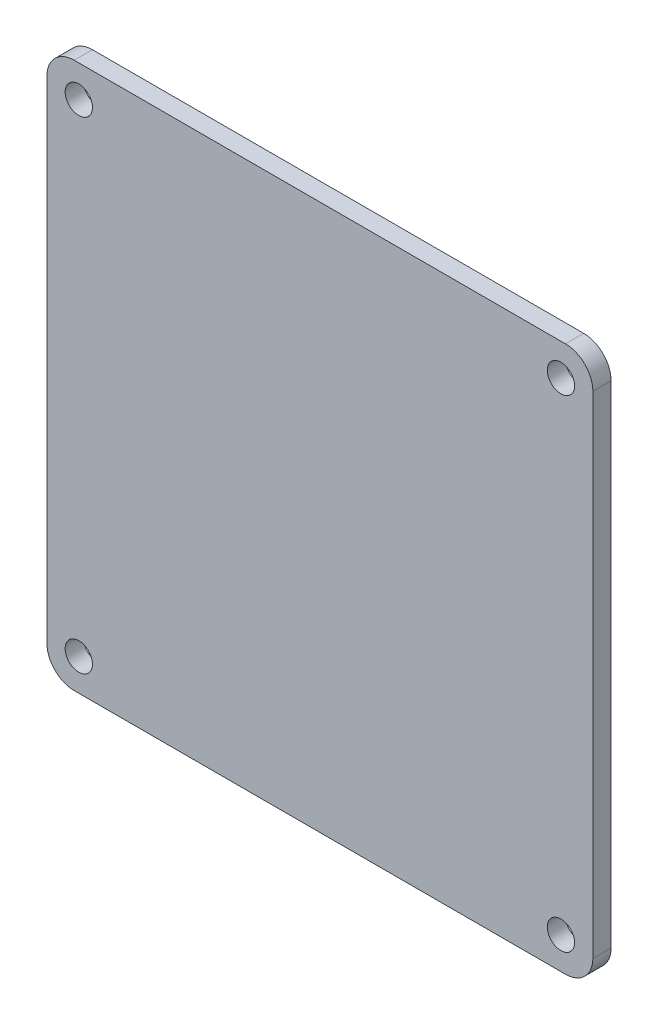
ISO-10303-21;
HEADER;
FILE_DESCRIPTION(('STEP AP214'),'2;1');
FILE_NAME('part.step','',(''),(''),'','','');
FILE_SCHEMA(('AUTOMOTIVE_DESIGN { 1 0 10303 214 1 1 1 1 }'));
ENDSEC;
DATA;
#1=APPLICATION_CONTEXT('core data for automotive mechanical design processes');
#2=APPLICATION_PROTOCOL_DEFINITION('international standard','automotive_design',2000,#1);
#3=PRODUCT_CONTEXT('',#1,'mechanical');
#4=PRODUCT('Part','Part','',(#3));
#5=PRODUCT_RELATED_PRODUCT_CATEGORY('part','',(#4));
#6=PRODUCT_DEFINITION_FORMATION('','',#4);
#7=PRODUCT_DEFINITION_CONTEXT('part definition',#1,'design');
#8=PRODUCT_DEFINITION('design','',#6,#7);
#9=PRODUCT_DEFINITION_SHAPE('','',#8);
#10=(LENGTH_UNIT() NAMED_UNIT(*) SI_UNIT(.MILLI.,.METRE.));
#11=(NAMED_UNIT(*) PLANE_ANGLE_UNIT() SI_UNIT($,.RADIAN.));
#12=(NAMED_UNIT(*) SI_UNIT($,.STERADIAN.) SOLID_ANGLE_UNIT());
#13=UNCERTAINTY_MEASURE_WITH_UNIT(LENGTH_MEASURE(1.E-05),#10,'distance_accuracy_value','');
#14=(GEOMETRIC_REPRESENTATION_CONTEXT(3) GLOBAL_UNCERTAINTY_ASSIGNED_CONTEXT((#13)) GLOBAL_UNIT_ASSIGNED_CONTEXT((#10,
#11,#12)) REPRESENTATION_CONTEXT('',''));
#15=CARTESIAN_POINT('',(0.,0.,0.));
#16=DIRECTION('',(0.,0.,1.));
#17=DIRECTION('',(1.,0.,0.));
#18=AXIS2_PLACEMENT_3D('',#15,#16,#17);
#19=CARTESIAN_POINT('',(0.,0.,2.));
#20=DIRECTION('',(0.,0.,1.));
#21=DIRECTION('',(1.,0.,0.));
#22=AXIS2_PLACEMENT_3D('',#19,#20,#21);
#23=PLANE('',#22);
#24=CARTESIAN_POINT('',(-26.45,26.45,2.));
#25=DIRECTION('',(0.,0.,1.));
#26=DIRECTION('',(1.,0.,0.));
#27=AXIS2_PLACEMENT_3D('',#24,#25,#26);
#28=CIRCLE('',#27,1.5);
#29=CARTESIAN_POINT('',(-24.95,26.45,2.));
#30=VERTEX_POINT('',#29);
#31=EDGE_CURVE('E191',#30,#30,#28,.T.);
#32=ORIENTED_EDGE('',*,*,#31,.F.);
#33=EDGE_LOOP('',(#32));
#34=FACE_BOUND('',#33,.T.);
#35=CARTESIAN_POINT('',(-26.45,-26.45,2.));
#36=DIRECTION('',(0.,0.,1.));
#37=DIRECTION('',(1.,0.,0.));
#38=AXIS2_PLACEMENT_3D('',#35,#36,#37);
#39=CIRCLE('',#38,1.5);
#40=CARTESIAN_POINT('',(-24.95,-26.45,2.));
#41=VERTEX_POINT('',#40);
#42=EDGE_CURVE('E129',#41,#41,#39,.T.);
#43=ORIENTED_EDGE('',*,*,#42,.F.);
#44=EDGE_LOOP('',(#43));
#45=FACE_BOUND('',#44,.T.);
#46=DIRECTION('',(1.,0.,0.));
#47=VECTOR('',#46,1.);
#48=CARTESIAN_POINT('',(-29.95,-29.95,2.));
#49=LINE('',#48,#47);
#50=CARTESIAN_POINT('',(-26.95,-29.95,2.));
#51=VERTEX_POINT('',#50);
#52=CARTESIAN_POINT('',(26.95,-29.95,2.));
#53=VERTEX_POINT('',#52);
#54=EDGE_CURVE('E138',#51,#53,#49,.T.);
#55=ORIENTED_EDGE('',*,*,#54,.T.);
#56=CARTESIAN_POINT('',(26.95,-26.95,2.));
#57=DIRECTION('',(0.,0.,1.));
#58=DIRECTION('',(1.,0.,0.));
#59=AXIS2_PLACEMENT_3D('',#56,#57,#58);
#60=CIRCLE('',#59,3.);
#61=CARTESIAN_POINT('',(29.95,-26.95,2.));
#62=VERTEX_POINT('',#61);
#63=EDGE_CURVE('E156',#53,#62,#60,.T.);
#64=ORIENTED_EDGE('',*,*,#63,.T.);
#65=DIRECTION('',(0.,1.,0.));
#66=VECTOR('',#65,1.);
#67=CARTESIAN_POINT('',(29.95,29.95,2.));
#68=LINE('',#67,#66);
#69=CARTESIAN_POINT('',(29.95,26.95,2.));
#70=VERTEX_POINT('',#69);
#71=EDGE_CURVE('E120',#62,#70,#68,.T.);
#72=ORIENTED_EDGE('',*,*,#71,.T.);
#73=CARTESIAN_POINT('',(26.95,26.95,2.));
#74=DIRECTION('',(0.,0.,1.));
#75=DIRECTION('',(1.,0.,0.));
#76=AXIS2_PLACEMENT_3D('',#73,#74,#75);
#77=CIRCLE('',#76,3.);
#78=CARTESIAN_POINT('',(26.95,29.95,2.));
#79=VERTEX_POINT('',#78);
#80=EDGE_CURVE('E152',#70,#79,#77,.T.);
#81=ORIENTED_EDGE('',*,*,#80,.T.);
#82=DIRECTION('',(-1.,0.,0.));
#83=VECTOR('',#82,1.);
#84=CARTESIAN_POINT('',(-29.95,29.95,2.));
#85=LINE('',#84,#83);
#86=CARTESIAN_POINT('',(-26.95,29.95,2.));
#87=VERTEX_POINT('',#86);
#88=EDGE_CURVE('E165',#79,#87,#85,.T.);
#89=ORIENTED_EDGE('',*,*,#88,.T.);
#90=CARTESIAN_POINT('',(-26.95,26.95,2.));
#91=DIRECTION('',(0.,0.,1.));
#92=DIRECTION('',(1.,0.,0.));
#93=AXIS2_PLACEMENT_3D('',#90,#91,#92);
#94=CIRCLE('',#93,3.);
#95=CARTESIAN_POINT('',(-29.95,26.95,2.));
#96=VERTEX_POINT('',#95);
#97=EDGE_CURVE('E55',#87,#96,#94,.T.);
#98=ORIENTED_EDGE('',*,*,#97,.T.);
#99=DIRECTION('',(0.,-1.,0.));
#100=VECTOR('',#99,1.);
#101=CARTESIAN_POINT('',(-29.95,29.95,2.));
#102=LINE('',#101,#100);
#103=CARTESIAN_POINT('',(-29.95,-26.95,2.));
#104=VERTEX_POINT('',#103);
#105=EDGE_CURVE('E171',#96,#104,#102,.T.);
#106=ORIENTED_EDGE('',*,*,#105,.T.);
#107=CARTESIAN_POINT('',(-26.95,-26.95,2.));
#108=DIRECTION('',(0.,0.,1.));
#109=DIRECTION('',(1.,0.,0.));
#110=AXIS2_PLACEMENT_3D('',#107,#108,#109);
#111=CIRCLE('',#110,3.);
#112=EDGE_CURVE('E154',#104,#51,#111,.T.);
#113=ORIENTED_EDGE('',*,*,#112,.T.);
#114=EDGE_LOOP('',(#55,#64,#72,#81,#89,#98,#106,#113));
#115=FACE_BOUND('',#114,.T.);
#116=CARTESIAN_POINT('',(26.45,-26.45,2.));
#117=DIRECTION('',(0.,0.,1.));
#118=DIRECTION('',(1.,0.,0.));
#119=AXIS2_PLACEMENT_3D('',#116,#117,#118);
#120=CIRCLE('',#119,1.5);
#121=CARTESIAN_POINT('',(27.95,-26.45,2.));
#122=VERTEX_POINT('',#121);
#123=EDGE_CURVE('E186',#122,#122,#120,.T.);
#124=ORIENTED_EDGE('',*,*,#123,.F.);
#125=EDGE_LOOP('',(#124));
#126=FACE_BOUND('',#125,.T.);
#127=CARTESIAN_POINT('',(26.45,26.45,2.));
#128=DIRECTION('',(0.,0.,1.));
#129=DIRECTION('',(1.,0.,0.));
#130=AXIS2_PLACEMENT_3D('',#127,#128,#129);
#131=CIRCLE('',#130,1.5);
#132=CARTESIAN_POINT('',(27.95,26.45,2.));
#133=VERTEX_POINT('',#132);
#134=EDGE_CURVE('E197',#133,#133,#131,.T.);
#135=ORIENTED_EDGE('',*,*,#134,.F.);
#136=EDGE_LOOP('',(#135));
#137=FACE_BOUND('',#136,.T.);
#138=ADVANCED_FACE('F33',(#34,#45,#115,#126,#137),#23,.T.);
#139=CARTESIAN_POINT('',(0.,0.,0.));
#140=DIRECTION('',(0.,0.,1.));
#141=DIRECTION('',(1.,0.,0.));
#142=AXIS2_PLACEMENT_3D('',#139,#140,#141);
#143=PLANE('',#142);
#144=CARTESIAN_POINT('',(-26.45,26.45,0.));
#145=DIRECTION('',(0.,0.,1.));
#146=DIRECTION('',(1.,0.,0.));
#147=AXIS2_PLACEMENT_3D('',#144,#145,#146);
#148=CIRCLE('',#147,1.5);
#149=CARTESIAN_POINT('',(-24.95,26.45,0.));
#150=VERTEX_POINT('',#149);
#151=EDGE_CURVE('E194',#150,#150,#148,.T.);
#152=ORIENTED_EDGE('',*,*,#151,.T.);
#153=EDGE_LOOP('',(#152));
#154=FACE_BOUND('',#153,.T.);
#155=CARTESIAN_POINT('',(-26.45,-26.45,0.));
#156=DIRECTION('',(0.,0.,1.));
#157=DIRECTION('',(1.,0.,0.));
#158=AXIS2_PLACEMENT_3D('',#155,#156,#157);
#159=CIRCLE('',#158,1.5);
#160=CARTESIAN_POINT('',(-24.95,-26.45,0.));
#161=VERTEX_POINT('',#160);
#162=EDGE_CURVE('E135',#161,#161,#159,.T.);
#163=ORIENTED_EDGE('',*,*,#162,.T.);
#164=EDGE_LOOP('',(#163));
#165=FACE_BOUND('',#164,.T.);
#166=DIRECTION('',(0.,1.,0.));
#167=VECTOR('',#166,1.);
#168=CARTESIAN_POINT('',(29.95,29.95,0.));
#169=LINE('',#168,#167);
#170=CARTESIAN_POINT('',(29.95,-26.95,0.));
#171=VERTEX_POINT('',#170);
#172=CARTESIAN_POINT('',(29.95,26.95,0.));
#173=VERTEX_POINT('',#172);
#174=EDGE_CURVE('E117',#171,#173,#169,.T.);
#175=ORIENTED_EDGE('',*,*,#174,.F.);
#176=CARTESIAN_POINT('',(26.95,-26.95,0.));
#177=DIRECTION('',(0.,0.,1.));
#178=DIRECTION('',(1.,0.,0.));
#179=AXIS2_PLACEMENT_3D('',#176,#177,#178);
#180=CIRCLE('',#179,3.);
#181=CARTESIAN_POINT('',(26.95,-29.95,0.));
#182=VERTEX_POINT('',#181);
#183=EDGE_CURVE('E100',#171,#182,#180,.F.);
#184=ORIENTED_EDGE('',*,*,#183,.T.);
#185=DIRECTION('',(1.,0.,0.));
#186=VECTOR('',#185,1.);
#187=CARTESIAN_POINT('',(-29.95,-29.95,0.));
#188=LINE('',#187,#186);
#189=CARTESIAN_POINT('',(-26.95,-29.95,0.));
#190=VERTEX_POINT('',#189);
#191=EDGE_CURVE('E142',#190,#182,#188,.T.);
#192=ORIENTED_EDGE('',*,*,#191,.F.);
#193=CARTESIAN_POINT('',(-26.95,-26.95,0.));
#194=DIRECTION('',(0.,0.,1.));
#195=DIRECTION('',(1.,0.,0.));
#196=AXIS2_PLACEMENT_3D('',#193,#194,#195);
#197=CIRCLE('',#196,3.);
#198=CARTESIAN_POINT('',(-29.95,-26.95,0.));
#199=VERTEX_POINT('',#198);
#200=EDGE_CURVE('E111',#190,#199,#197,.F.);
#201=ORIENTED_EDGE('',*,*,#200,.T.);
#202=DIRECTION('',(0.,-1.,0.));
#203=VECTOR('',#202,1.);
#204=CARTESIAN_POINT('',(-29.95,29.95,0.));
#205=LINE('',#204,#203);
#206=CARTESIAN_POINT('',(-29.95,26.95,0.));
#207=VERTEX_POINT('',#206);
#208=EDGE_CURVE('E132',#207,#199,#205,.T.);
#209=ORIENTED_EDGE('',*,*,#208,.F.);
#210=CARTESIAN_POINT('',(-26.95,26.95,0.));
#211=DIRECTION('',(0.,0.,1.));
#212=DIRECTION('',(1.,0.,0.));
#213=AXIS2_PLACEMENT_3D('',#210,#211,#212);
#214=CIRCLE('',#213,3.);
#215=CARTESIAN_POINT('',(-26.95,29.95,0.));
#216=VERTEX_POINT('',#215);
#217=EDGE_CURVE('E121',#207,#216,#214,.F.);
#218=ORIENTED_EDGE('',*,*,#217,.T.);
#219=DIRECTION('',(-1.,0.,0.));
#220=VECTOR('',#219,1.);
#221=CARTESIAN_POINT('',(-29.95,29.95,0.));
#222=LINE('',#221,#220);
#223=CARTESIAN_POINT('',(26.95,29.95,0.));
#224=VERTEX_POINT('',#223);
#225=EDGE_CURVE('E128',#224,#216,#222,.T.);
#226=ORIENTED_EDGE('',*,*,#225,.F.);
#227=CARTESIAN_POINT('',(26.95,26.95,0.));
#228=DIRECTION('',(0.,0.,1.));
#229=DIRECTION('',(1.,0.,0.));
#230=AXIS2_PLACEMENT_3D('',#227,#228,#229);
#231=CIRCLE('',#230,3.);
#232=EDGE_CURVE('E127',#224,#173,#231,.F.);
#233=ORIENTED_EDGE('',*,*,#232,.T.);
#234=EDGE_LOOP('',(#175,#184,#192,#201,#209,#218,#226,#233));
#235=FACE_BOUND('',#234,.T.);
#236=CARTESIAN_POINT('',(26.45,-26.45,0.));
#237=DIRECTION('',(0.,0.,1.));
#238=DIRECTION('',(1.,0.,0.));
#239=AXIS2_PLACEMENT_3D('',#236,#237,#238);
#240=CIRCLE('',#239,1.5);
#241=CARTESIAN_POINT('',(27.95,-26.45,0.));
#242=VERTEX_POINT('',#241);
#243=EDGE_CURVE('E188',#242,#242,#240,.T.);
#244=ORIENTED_EDGE('',*,*,#243,.T.);
#245=EDGE_LOOP('',(#244));
#246=FACE_BOUND('',#245,.T.);
#247=CARTESIAN_POINT('',(26.45,26.45,0.));
#248=DIRECTION('',(0.,0.,1.));
#249=DIRECTION('',(1.,0.,0.));
#250=AXIS2_PLACEMENT_3D('',#247,#248,#249);
#251=CIRCLE('',#250,1.5);
#252=CARTESIAN_POINT('',(27.95,26.45,0.));
#253=VERTEX_POINT('',#252);
#254=EDGE_CURVE('E200',#253,#253,#251,.T.);
#255=ORIENTED_EDGE('',*,*,#254,.T.);
#256=EDGE_LOOP('',(#255));
#257=FACE_BOUND('',#256,.T.);
#258=ADVANCED_FACE('F124',(#154,#165,#235,#246,#257),#143,.F.);
#259=CARTESIAN_POINT('',(29.95,29.95,2.));
#260=DIRECTION('',(-1.,0.,0.));
#261=DIRECTION('',(0.,-1.,0.));
#262=AXIS2_PLACEMENT_3D('',#259,#260,#261);
#263=PLANE('',#262);
#264=ORIENTED_EDGE('',*,*,#71,.F.);
#265=DIRECTION('',(0.,0.,-1.));
#266=VECTOR('',#265,1.);
#267=CARTESIAN_POINT('',(29.95,-26.95,2.));
#268=LINE('',#267,#266);
#269=EDGE_CURVE('E104',#62,#171,#268,.T.);
#270=ORIENTED_EDGE('',*,*,#269,.T.);
#271=ORIENTED_EDGE('',*,*,#174,.T.);
#272=DIRECTION('',(0.,0.,-1.));
#273=VECTOR('',#272,1.);
#274=CARTESIAN_POINT('',(29.95,26.95,2.));
#275=LINE('',#274,#273);
#276=EDGE_CURVE('E122',#173,#70,#275,.F.);
#277=ORIENTED_EDGE('',*,*,#276,.T.);
#278=EDGE_LOOP('',(#264,#270,#271,#277));
#279=FACE_BOUND('',#278,.T.);
#280=ADVANCED_FACE('F116',(#279),#263,.F.);
#281=CARTESIAN_POINT('',(-29.95,29.95,2.));
#282=DIRECTION('',(0.,-1.,0.));
#283=DIRECTION('',(0.,0.,-1.));
#284=AXIS2_PLACEMENT_3D('',#281,#282,#283);
#285=PLANE('',#284);
#286=ORIENTED_EDGE('',*,*,#88,.F.);
#287=DIRECTION('',(0.,0.,-1.));
#288=VECTOR('',#287,1.);
#289=CARTESIAN_POINT('',(26.95,29.95,2.));
#290=LINE('',#289,#288);
#291=EDGE_CURVE('E11',#79,#224,#290,.T.);
#292=ORIENTED_EDGE('',*,*,#291,.T.);
#293=ORIENTED_EDGE('',*,*,#225,.T.);
#294=DIRECTION('',(0.,0.,-1.));
#295=VECTOR('',#294,1.);
#296=CARTESIAN_POINT('',(-26.95,29.95,2.));
#297=LINE('',#296,#295);
#298=EDGE_CURVE('E41',#216,#87,#297,.F.);
#299=ORIENTED_EDGE('',*,*,#298,.T.);
#300=EDGE_LOOP('',(#286,#292,#293,#299));
#301=FACE_BOUND('',#300,.T.);
#302=ADVANCED_FACE('F164',(#301),#285,.F.);
#303=CARTESIAN_POINT('',(-29.95,29.95,2.));
#304=DIRECTION('',(1.,0.,0.));
#305=DIRECTION('',(0.,1.,0.));
#306=AXIS2_PLACEMENT_3D('',#303,#304,#305);
#307=PLANE('',#306);
#308=ORIENTED_EDGE('',*,*,#208,.T.);
#309=DIRECTION('',(0.,0.,-1.));
#310=VECTOR('',#309,1.);
#311=CARTESIAN_POINT('',(-29.95,-26.95,2.));
#312=LINE('',#311,#310);
#313=EDGE_CURVE('E48',#199,#104,#312,.F.);
#314=ORIENTED_EDGE('',*,*,#313,.T.);
#315=ORIENTED_EDGE('',*,*,#105,.F.);
#316=DIRECTION('',(0.,0.,-1.));
#317=VECTOR('',#316,1.);
#318=CARTESIAN_POINT('',(-29.95,26.95,2.));
#319=LINE('',#318,#317);
#320=EDGE_CURVE('E158',#96,#207,#319,.T.);
#321=ORIENTED_EDGE('',*,*,#320,.T.);
#322=EDGE_LOOP('',(#308,#314,#315,#321));
#323=FACE_BOUND('',#322,.T.);
#324=ADVANCED_FACE('F175',(#323),#307,.F.);
#325=CARTESIAN_POINT('',(-29.95,-29.95,2.));
#326=DIRECTION('',(0.,1.,0.));
#327=DIRECTION('',(0.,0.,1.));
#328=AXIS2_PLACEMENT_3D('',#325,#326,#327);
#329=PLANE('',#328);
#330=ORIENTED_EDGE('',*,*,#191,.T.);
#331=DIRECTION('',(0.,0.,-1.));
#332=VECTOR('',#331,1.);
#333=CARTESIAN_POINT('',(26.95,-29.95,2.));
#334=LINE('',#333,#332);
#335=EDGE_CURVE('E105',#182,#53,#334,.F.);
#336=ORIENTED_EDGE('',*,*,#335,.T.);
#337=ORIENTED_EDGE('',*,*,#54,.F.);
#338=DIRECTION('',(0.,0.,-1.));
#339=VECTOR('',#338,1.);
#340=CARTESIAN_POINT('',(-26.95,-29.95,2.));
#341=LINE('',#340,#339);
#342=EDGE_CURVE('E110',#51,#190,#341,.T.);
#343=ORIENTED_EDGE('',*,*,#342,.T.);
#344=EDGE_LOOP('',(#330,#336,#337,#343));
#345=FACE_BOUND('',#344,.T.);
#346=ADVANCED_FACE('F182',(#345),#329,.F.);
#347=CARTESIAN_POINT('',(-26.45,-26.45,2.));
#348=DIRECTION('',(0.,0.,-1.));
#349=DIRECTION('',(-1.,0.,0.));
#350=AXIS2_PLACEMENT_3D('',#347,#348,#349);
#351=CYLINDRICAL_SURFACE('',#350,1.5);
#352=ORIENTED_EDGE('',*,*,#42,.T.);
#353=EDGE_LOOP('',(#352));
#354=FACE_BOUND('',#353,.T.);
#355=ORIENTED_EDGE('',*,*,#162,.F.);
#356=EDGE_LOOP('',(#355));
#357=FACE_BOUND('',#356,.T.);
#358=ADVANCED_FACE('F220',(#354,#357),#351,.F.);
#359=CARTESIAN_POINT('',(26.45,-26.45,2.));
#360=DIRECTION('',(0.,0.,-1.));
#361=DIRECTION('',(-1.,0.,0.));
#362=AXIS2_PLACEMENT_3D('',#359,#360,#361);
#363=CYLINDRICAL_SURFACE('',#362,1.5);
#364=ORIENTED_EDGE('',*,*,#123,.T.);
#365=EDGE_LOOP('',(#364));
#366=FACE_BOUND('',#365,.T.);
#367=ORIENTED_EDGE('',*,*,#243,.F.);
#368=EDGE_LOOP('',(#367));
#369=FACE_BOUND('',#368,.T.);
#370=ADVANCED_FACE('F312',(#366,#369),#363,.F.);
#371=CARTESIAN_POINT('',(-26.45,26.45,2.));
#372=DIRECTION('',(0.,0.,-1.));
#373=DIRECTION('',(-1.,0.,0.));
#374=AXIS2_PLACEMENT_3D('',#371,#372,#373);
#375=CYLINDRICAL_SURFACE('',#374,1.5);
#376=ORIENTED_EDGE('',*,*,#31,.T.);
#377=EDGE_LOOP('',(#376));
#378=FACE_BOUND('',#377,.T.);
#379=ORIENTED_EDGE('',*,*,#151,.F.);
#380=EDGE_LOOP('',(#379));
#381=FACE_BOUND('',#380,.T.);
#382=ADVANCED_FACE('F303',(#378,#381),#375,.F.);
#383=CARTESIAN_POINT('',(26.45,26.45,2.));
#384=DIRECTION('',(0.,0.,-1.));
#385=DIRECTION('',(-1.,0.,0.));
#386=AXIS2_PLACEMENT_3D('',#383,#384,#385);
#387=CYLINDRICAL_SURFACE('',#386,1.5);
#388=ORIENTED_EDGE('',*,*,#134,.T.);
#389=EDGE_LOOP('',(#388));
#390=FACE_BOUND('',#389,.T.);
#391=ORIENTED_EDGE('',*,*,#254,.F.);
#392=EDGE_LOOP('',(#391));
#393=FACE_BOUND('',#392,.T.);
#394=ADVANCED_FACE('F206',(#390,#393),#387,.F.);
#395=CARTESIAN_POINT('',(26.95,-26.95,2.));
#396=DIRECTION('',(0.,0.,-1.));
#397=DIRECTION('',(-1.,0.,0.));
#398=AXIS2_PLACEMENT_3D('',#395,#396,#397);
#399=CYLINDRICAL_SURFACE('',#398,3.);
#400=ORIENTED_EDGE('',*,*,#63,.F.);
#401=ORIENTED_EDGE('',*,*,#335,.F.);
#402=ORIENTED_EDGE('',*,*,#183,.F.);
#403=ORIENTED_EDGE('',*,*,#269,.F.);
#404=EDGE_LOOP('',(#400,#401,#402,#403));
#405=FACE_BOUND('',#404,.T.);
#406=ADVANCED_FACE('F103',(#405),#399,.T.);
#407=CARTESIAN_POINT('',(-26.95,-26.95,2.));
#408=DIRECTION('',(0.,0.,-1.));
#409=DIRECTION('',(-1.,0.,0.));
#410=AXIS2_PLACEMENT_3D('',#407,#408,#409);
#411=CYLINDRICAL_SURFACE('',#410,3.);
#412=ORIENTED_EDGE('',*,*,#112,.F.);
#413=ORIENTED_EDGE('',*,*,#313,.F.);
#414=ORIENTED_EDGE('',*,*,#200,.F.);
#415=ORIENTED_EDGE('',*,*,#342,.F.);
#416=EDGE_LOOP('',(#412,#413,#414,#415));
#417=FACE_BOUND('',#416,.T.);
#418=ADVANCED_FACE('F179',(#417),#411,.T.);
#419=CARTESIAN_POINT('',(26.95,26.95,2.));
#420=DIRECTION('',(0.,0.,-1.));
#421=DIRECTION('',(-1.,0.,0.));
#422=AXIS2_PLACEMENT_3D('',#419,#420,#421);
#423=CYLINDRICAL_SURFACE('',#422,3.);
#424=ORIENTED_EDGE('',*,*,#80,.F.);
#425=ORIENTED_EDGE('',*,*,#276,.F.);
#426=ORIENTED_EDGE('',*,*,#232,.F.);
#427=ORIENTED_EDGE('',*,*,#291,.F.);
#428=EDGE_LOOP('',(#424,#425,#426,#427));
#429=FACE_BOUND('',#428,.T.);
#430=ADVANCED_FACE('F234',(#429),#423,.T.);
#431=CARTESIAN_POINT('',(-26.95,26.95,2.));
#432=DIRECTION('',(0.,0.,-1.));
#433=DIRECTION('',(-1.,0.,0.));
#434=AXIS2_PLACEMENT_3D('',#431,#432,#433);
#435=CYLINDRICAL_SURFACE('',#434,3.);
#436=ORIENTED_EDGE('',*,*,#97,.F.);
#437=ORIENTED_EDGE('',*,*,#298,.F.);
#438=ORIENTED_EDGE('',*,*,#217,.F.);
#439=ORIENTED_EDGE('',*,*,#320,.F.);
#440=EDGE_LOOP('',(#436,#437,#438,#439));
#441=FACE_BOUND('',#440,.T.);
#442=ADVANCED_FACE('F35',(#441),#435,.T.);
#443=CLOSED_SHELL('',(#138,#258,#280,#302,#324,#346,#358,#370,#382,#394,#406,#418,#430,#442));
#444=MANIFOLD_SOLID_BREP('B2',#443);
#445=ADVANCED_BREP_SHAPE_REPRESENTATION('',(#18,#444),#14);
#446=SHAPE_DEFINITION_REPRESENTATION(#9,#445);
ENDSEC;
END-ISO-10303-21;
